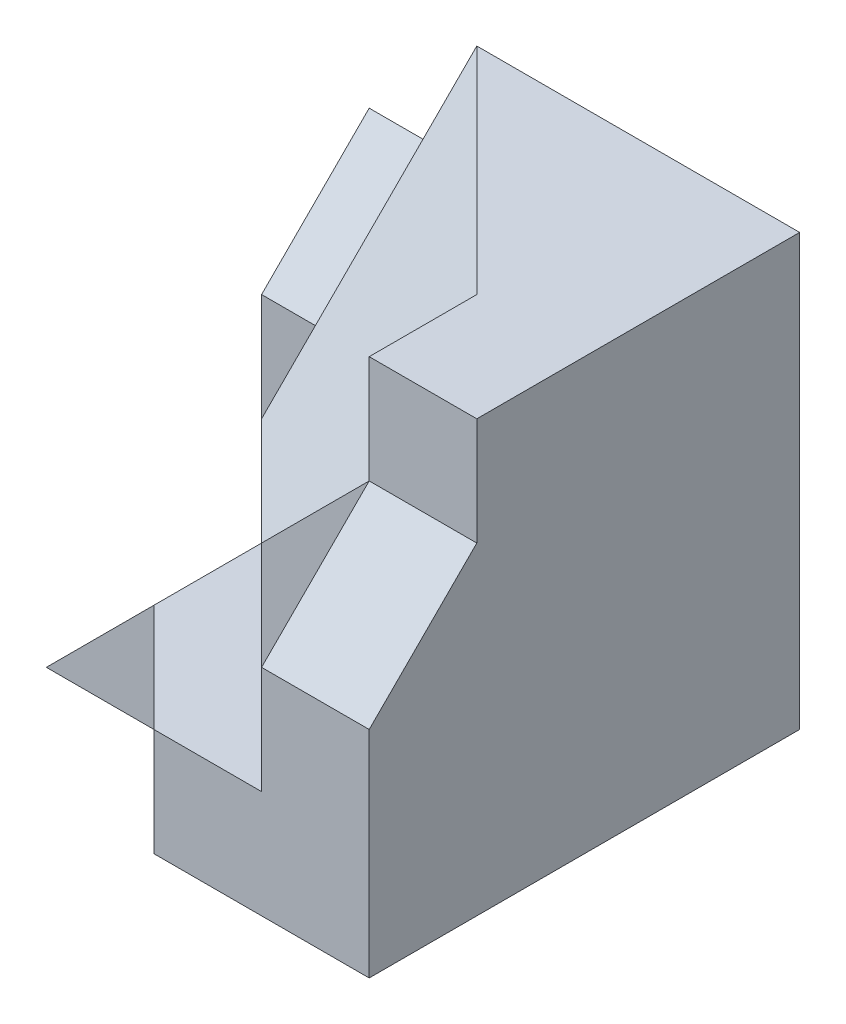
ISO-10303-21;
HEADER;
FILE_DESCRIPTION(('STEP AP214'),'2;1');
FILE_NAME('part.step','',(''),(''),'','','');
FILE_SCHEMA(('AUTOMOTIVE_DESIGN { 1 0 10303 214 1 1 1 1 }'));
ENDSEC;
DATA;
#1=APPLICATION_CONTEXT('core data for automotive mechanical design processes');
#2=APPLICATION_PROTOCOL_DEFINITION('international standard','automotive_design',2000,#1);
#3=PRODUCT_CONTEXT('',#1,'mechanical');
#4=PRODUCT('Part','Part','',(#3));
#5=PRODUCT_RELATED_PRODUCT_CATEGORY('part','',(#4));
#6=PRODUCT_DEFINITION_FORMATION('','',#4);
#7=PRODUCT_DEFINITION_CONTEXT('part definition',#1,'design');
#8=PRODUCT_DEFINITION('design','',#6,#7);
#9=PRODUCT_DEFINITION_SHAPE('','',#8);
#10=(LENGTH_UNIT() NAMED_UNIT(*) SI_UNIT(.MILLI.,.METRE.));
#11=(NAMED_UNIT(*) PLANE_ANGLE_UNIT() SI_UNIT($,.RADIAN.));
#12=(NAMED_UNIT(*) SI_UNIT($,.STERADIAN.) SOLID_ANGLE_UNIT());
#13=UNCERTAINTY_MEASURE_WITH_UNIT(LENGTH_MEASURE(1.E-05),#10,'distance_accuracy_value','');
#14=(GEOMETRIC_REPRESENTATION_CONTEXT(3) GLOBAL_UNCERTAINTY_ASSIGNED_CONTEXT((#13)) GLOBAL_UNIT_ASSIGNED_CONTEXT((#10,
#11,#12)) REPRESENTATION_CONTEXT('',''));
#15=CARTESIAN_POINT('',(0.,0.,0.));
#16=DIRECTION('',(0.,0.,1.));
#17=DIRECTION('',(1.,0.,0.));
#18=AXIS2_PLACEMENT_3D('',#15,#16,#17);
#19=CARTESIAN_POINT('',(0.,20.,15.));
#20=DIRECTION('',(0.,0.,-1.));
#21=DIRECTION('',(-1.,0.,0.));
#22=AXIS2_PLACEMENT_3D('',#19,#20,#21);
#23=PLANE('',#22);
#24=DIRECTION('',(1.,0.,0.));
#25=VECTOR('',#24,1.);
#26=CARTESIAN_POINT('',(-10.,5.,15.));
#27=LINE('',#26,#25);
#28=CARTESIAN_POINT('',(-10.,5.,15.));
#29=VERTEX_POINT('',#28);
#30=CARTESIAN_POINT('',(-5.,5.,15.));
#31=VERTEX_POINT('',#30);
#32=EDGE_CURVE('E311',#29,#31,#27,.T.);
#33=ORIENTED_EDGE('',*,*,#32,.T.);
#34=DIRECTION('',(0.,-1.,0.));
#35=VECTOR('',#34,1.);
#36=CARTESIAN_POINT('',(-5.,20.,15.));
#37=LINE('',#36,#35);
#38=CARTESIAN_POINT('',(-5.,15.,15.));
#39=VERTEX_POINT('',#38);
#40=EDGE_CURVE('E243',#39,#31,#37,.T.);
#41=ORIENTED_EDGE('',*,*,#40,.F.);
#42=DIRECTION('',(-0.707106781186548,-0.707106781186547,0.));
#43=VECTOR('',#42,1.);
#44=CARTESIAN_POINT('',(-5.,15.,15.));
#45=LINE('',#44,#43);
#46=CARTESIAN_POINT('',(-10.,10.,15.));
#47=VERTEX_POINT('',#46);
#48=EDGE_CURVE('E211',#39,#47,#45,.T.);
#49=ORIENTED_EDGE('',*,*,#48,.T.);
#50=DIRECTION('',(0.,-1.,0.));
#51=VECTOR('',#50,1.);
#52=CARTESIAN_POINT('',(-10.,20.,15.));
#53=LINE('',#52,#51);
#54=EDGE_CURVE('E255',#47,#29,#53,.T.);
#55=ORIENTED_EDGE('',*,*,#54,.T.);
#56=EDGE_LOOP('',(#33,#41,#49,#55));
#57=FACE_BOUND('',#56,.T.);
#58=ADVANCED_FACE('F34',(#57),#23,.F.);
#59=CARTESIAN_POINT('',(-15.,20.,9.99999999999999));
#60=DIRECTION('',(-0.707106781186548,0.,0.707106781186547));
#61=DIRECTION('',(0.707106781186547,0.,0.707106781186548));
#62=AXIS2_PLACEMENT_3D('',#59,#60,#61);
#63=PLANE('',#62);
#64=DIRECTION('',(0.,-1.,0.));
#65=VECTOR('',#64,1.);
#66=CARTESIAN_POINT('',(-15.,20.,9.99999999999999));
#67=LINE('',#66,#65);
#68=CARTESIAN_POINT('',(-15.,10.,9.99999999999999));
#69=VERTEX_POINT('',#68);
#70=CARTESIAN_POINT('',(-15.,5.,9.99999999999999));
#71=VERTEX_POINT('',#70);
#72=EDGE_CURVE('E251',#69,#71,#67,.T.);
#73=ORIENTED_EDGE('',*,*,#72,.T.);
#74=DIRECTION('',(0.707106781186547,0.,0.707106781186548));
#75=VECTOR('',#74,1.);
#76=CARTESIAN_POINT('',(-15.,5.,9.99999999999999));
#77=LINE('',#76,#75);
#78=EDGE_CURVE('E148',#71,#29,#77,.T.);
#79=ORIENTED_EDGE('',*,*,#78,.T.);
#80=ORIENTED_EDGE('',*,*,#54,.F.);
#81=DIRECTION('',(-0.707106781186548,0.,-0.707106781186548));
#82=VECTOR('',#81,1.);
#83=CARTESIAN_POINT('',(-10.,10.,15.));
#84=LINE('',#83,#82);
#85=EDGE_CURVE('E207',#47,#69,#84,.T.);
#86=ORIENTED_EDGE('',*,*,#85,.T.);
#87=EDGE_LOOP('',(#73,#79,#80,#86));
#88=FACE_BOUND('',#87,.T.);
#89=ADVANCED_FACE('F312',(#88),#63,.T.);
#90=CARTESIAN_POINT('',(-5.,20.,15.));
#91=DIRECTION('',(1.,0.,0.));
#92=DIRECTION('',(0.,0.,-1.));
#93=AXIS2_PLACEMENT_3D('',#90,#91,#92);
#94=PLANE('',#93);
#95=DIRECTION('',(0.,0.,1.));
#96=VECTOR('',#95,1.);
#97=CARTESIAN_POINT('',(-5.,5.,15.));
#98=LINE('',#97,#96);
#99=CARTESIAN_POINT('',(-5.,5.,20.));
#100=VERTEX_POINT('',#99);
#101=EDGE_CURVE('E314',#31,#100,#98,.T.);
#102=ORIENTED_EDGE('',*,*,#101,.T.);
#103=DIRECTION('',(0.,-1.,0.));
#104=VECTOR('',#103,1.);
#105=CARTESIAN_POINT('',(-5.,0.,20.));
#106=LINE('',#105,#104);
#107=CARTESIAN_POINT('',(-5.,10.,20.));
#108=VERTEX_POINT('',#107);
#109=EDGE_CURVE('E279',#108,#100,#106,.T.);
#110=ORIENTED_EDGE('',*,*,#109,.F.);
#111=DIRECTION('',(0.,-0.707106781186548,0.707106781186548));
#112=VECTOR('',#111,1.);
#113=CARTESIAN_POINT('',(-5.,15.,15.));
#114=LINE('',#113,#112);
#115=EDGE_CURVE('E254',#39,#108,#114,.T.);
#116=ORIENTED_EDGE('',*,*,#115,.F.);
#117=ORIENTED_EDGE('',*,*,#40,.T.);
#118=EDGE_LOOP('',(#102,#110,#116,#117));
#119=FACE_BOUND('',#118,.T.);
#120=ADVANCED_FACE('F36',(#119),#94,.F.);
#121=CARTESIAN_POINT('',(-15.,20.,0.));
#122=DIRECTION('',(-1.,0.,0.));
#123=DIRECTION('',(0.,0.,1.));
#124=AXIS2_PLACEMENT_3D('',#121,#122,#123);
#125=PLANE('',#124);
#126=DIRECTION('',(0.,1.,0.));
#127=VECTOR('',#126,1.);
#128=CARTESIAN_POINT('',(-15.,10.,5.));
#129=LINE('',#128,#127);
#130=CARTESIAN_POINT('',(-15.,5.,5.));
#131=VERTEX_POINT('',#130);
#132=CARTESIAN_POINT('',(-15.,10.,5.));
#133=VERTEX_POINT('',#132);
#134=EDGE_CURVE('E38',#131,#133,#129,.T.);
#135=ORIENTED_EDGE('',*,*,#134,.F.);
#136=DIRECTION('',(0.,0.,-1.));
#137=VECTOR('',#136,1.);
#138=CARTESIAN_POINT('',(-15.,5.,15.));
#139=LINE('',#138,#137);
#140=EDGE_CURVE('E152',#71,#131,#139,.T.);
#141=ORIENTED_EDGE('',*,*,#140,.F.);
#142=ORIENTED_EDGE('',*,*,#72,.F.);
#143=DIRECTION('',(0.,0.707106781186547,-0.707106781186548));
#144=VECTOR('',#143,1.);
#145=CARTESIAN_POINT('',(-15.,10.,10.));
#146=LINE('',#145,#144);
#147=CARTESIAN_POINT('',(-15.,20.,0.));
#148=VERTEX_POINT('',#147);
#149=EDGE_CURVE('E59',#69,#148,#146,.T.);
#150=ORIENTED_EDGE('',*,*,#149,.T.);
#151=DIRECTION('',(0.,-1.,0.));
#152=VECTOR('',#151,1.);
#153=CARTESIAN_POINT('',(-15.,20.,0.));
#154=LINE('',#153,#152);
#155=CARTESIAN_POINT('',(-15.,15.,0.));
#156=VERTEX_POINT('',#155);
#157=EDGE_CURVE('E52',#148,#156,#154,.T.);
#158=ORIENTED_EDGE('',*,*,#157,.T.);
#159=DIRECTION('',(0.,0.707106781186548,-0.707106781186548));
#160=VECTOR('',#159,1.);
#161=CARTESIAN_POINT('',(-15.,15.,0.));
#162=LINE('',#161,#160);
#163=EDGE_CURVE('E185',#133,#156,#162,.T.);
#164=ORIENTED_EDGE('',*,*,#163,.F.);
#165=EDGE_LOOP('',(#135,#141,#142,#150,#158,#164));
#166=FACE_BOUND('',#165,.T.);
#167=ADVANCED_FACE('F326',(#166),#125,.T.);
#168=CARTESIAN_POINT('',(-20.,10.,5.));
#169=DIRECTION('',(0.,0.,-1.));
#170=DIRECTION('',(0.,1.,0.));
#171=AXIS2_PLACEMENT_3D('',#168,#169,#170);
#172=PLANE('',#171);
#173=DIRECTION('',(0.,1.,0.));
#174=VECTOR('',#173,1.);
#175=CARTESIAN_POINT('',(-20.,10.,5.));
#176=LINE('',#175,#174);
#177=CARTESIAN_POINT('',(-20.,0.,5.));
#178=VERTEX_POINT('',#177);
#179=CARTESIAN_POINT('',(-20.,10.,5.));
#180=VERTEX_POINT('',#179);
#181=EDGE_CURVE('E184',#178,#180,#176,.T.);
#182=ORIENTED_EDGE('',*,*,#181,.F.);
#183=DIRECTION('',(0.707106781186548,0.707106781186548,0.));
#184=VECTOR('',#183,1.);
#185=CARTESIAN_POINT('',(-20.,0.,5.));
#186=LINE('',#185,#184);
#187=EDGE_CURVE('E173',#178,#131,#186,.T.);
#188=ORIENTED_EDGE('',*,*,#187,.T.);
#189=ORIENTED_EDGE('',*,*,#134,.T.);
#190=DIRECTION('',(1.,0.,0.));
#191=VECTOR('',#190,1.);
#192=CARTESIAN_POINT('',(-20.,10.,5.));
#193=LINE('',#192,#191);
#194=EDGE_CURVE('E195',#180,#133,#193,.T.);
#195=ORIENTED_EDGE('',*,*,#194,.F.);
#196=EDGE_LOOP('',(#182,#188,#189,#195));
#197=FACE_BOUND('',#196,.T.);
#198=ADVANCED_FACE('F325',(#197),#172,.F.);
#199=DIRECTION('',(0.,1.,0.));
#200=VECTOR('',#199,1.);
#201=CARTESIAN_POINT('',(-5.,20.,15.));
#202=LINE('',#201,#200);
#203=CARTESIAN_POINT('',(-5.,20.,15.));
#204=VERTEX_POINT('',#203);
#205=EDGE_CURVE('E223',#39,#204,#202,.T.);
#206=ORIENTED_EDGE('',*,*,#205,.F.);
#207=DIRECTION('',(-1.,0.,0.));
#208=VECTOR('',#207,1.);
#209=CARTESIAN_POINT('',(-5.,15.,15.));
#210=LINE('',#209,#208);
#211=CARTESIAN_POINT('',(0.,15.,15.));
#212=VERTEX_POINT('',#211);
#213=EDGE_CURVE('E275',#212,#39,#210,.T.);
#214=ORIENTED_EDGE('',*,*,#213,.F.);
#215=DIRECTION('',(0.,-1.,0.));
#216=VECTOR('',#215,1.);
#217=CARTESIAN_POINT('',(0.,20.,15.));
#218=LINE('',#217,#216);
#219=CARTESIAN_POINT('',(0.,20.,15.));
#220=VERTEX_POINT('',#219);
#221=EDGE_CURVE('E12',#220,#212,#218,.T.);
#222=ORIENTED_EDGE('',*,*,#221,.F.);
#223=DIRECTION('',(1.,0.,0.));
#224=VECTOR('',#223,1.);
#225=CARTESIAN_POINT('',(0.,20.,15.));
#226=LINE('',#225,#224);
#227=EDGE_CURVE('E288',#204,#220,#226,.T.);
#228=ORIENTED_EDGE('',*,*,#227,.F.);
#229=EDGE_LOOP('',(#206,#214,#222,#228));
#230=FACE_BOUND('',#229,.T.);
#231=ADVANCED_FACE('F348',(#230),#23,.F.);
#232=CARTESIAN_POINT('',(0.,20.,0.));
#233=DIRECTION('',(-1.,0.,0.));
#234=DIRECTION('',(0.,0.,1.));
#235=AXIS2_PLACEMENT_3D('',#232,#233,#234);
#236=PLANE('',#235);
#237=ORIENTED_EDGE('',*,*,#221,.T.);
#238=DIRECTION('',(0.,-0.707106781186548,0.707106781186548));
#239=VECTOR('',#238,1.);
#240=CARTESIAN_POINT('',(0.,15.,15.));
#241=LINE('',#240,#239);
#242=CARTESIAN_POINT('',(0.,10.,20.));
#243=VERTEX_POINT('',#242);
#244=EDGE_CURVE('E281',#212,#243,#241,.T.);
#245=ORIENTED_EDGE('',*,*,#244,.T.);
#246=DIRECTION('',(0.,1.,0.));
#247=VECTOR('',#246,1.);
#248=CARTESIAN_POINT('',(0.,15.,20.));
#249=LINE('',#248,#247);
#250=CARTESIAN_POINT('',(0.,0.,20.));
#251=VERTEX_POINT('',#250);
#252=EDGE_CURVE('E286',#251,#243,#249,.T.);
#253=ORIENTED_EDGE('',*,*,#252,.F.);
#254=DIRECTION('',(0.,0.,-1.));
#255=VECTOR('',#254,1.);
#256=CARTESIAN_POINT('',(0.,0.,0.));
#257=LINE('',#256,#255);
#258=CARTESIAN_POINT('',(0.,0.,0.));
#259=VERTEX_POINT('',#258);
#260=EDGE_CURVE('E290',#251,#259,#257,.T.);
#261=ORIENTED_EDGE('',*,*,#260,.T.);
#262=DIRECTION('',(0.,-1.,0.));
#263=VECTOR('',#262,1.);
#264=CARTESIAN_POINT('',(0.,20.,0.));
#265=LINE('',#264,#263);
#266=CARTESIAN_POINT('',(0.,20.,0.));
#267=VERTEX_POINT('',#266);
#268=EDGE_CURVE('E44',#267,#259,#265,.T.);
#269=ORIENTED_EDGE('',*,*,#268,.F.);
#270=DIRECTION('',(0.,0.,-1.));
#271=VECTOR('',#270,1.);
#272=CARTESIAN_POINT('',(0.,20.,0.));
#273=LINE('',#272,#271);
#274=EDGE_CURVE('E260',#220,#267,#273,.T.);
#275=ORIENTED_EDGE('',*,*,#274,.F.);
#276=EDGE_LOOP('',(#237,#245,#253,#261,#269,#275));
#277=FACE_BOUND('',#276,.T.);
#278=ADVANCED_FACE('F341',(#277),#236,.F.);
#279=CARTESIAN_POINT('',(-15.,20.,0.));
#280=DIRECTION('',(0.,0.,1.));
#281=DIRECTION('',(1.,0.,0.));
#282=AXIS2_PLACEMENT_3D('',#279,#280,#281);
#283=PLANE('',#282);
#284=DIRECTION('',(-1.,0.,0.));
#285=VECTOR('',#284,1.);
#286=CARTESIAN_POINT('',(-15.,0.,0.));
#287=LINE('',#286,#285);
#288=CARTESIAN_POINT('',(-20.,0.,0.));
#289=VERTEX_POINT('',#288);
#290=EDGE_CURVE('E271',#259,#289,#287,.T.);
#291=ORIENTED_EDGE('',*,*,#290,.T.);
#292=DIRECTION('',(0.,-1.,0.));
#293=VECTOR('',#292,1.);
#294=CARTESIAN_POINT('',(-20.,0.,0.));
#295=LINE('',#294,#293);
#296=CARTESIAN_POINT('',(-20.,15.,0.));
#297=VERTEX_POINT('',#296);
#298=EDGE_CURVE('E189',#297,#289,#295,.T.);
#299=ORIENTED_EDGE('',*,*,#298,.F.);
#300=DIRECTION('',(1.,0.,0.));
#301=VECTOR('',#300,1.);
#302=CARTESIAN_POINT('',(-20.,15.,0.));
#303=LINE('',#302,#301);
#304=EDGE_CURVE('E192',#297,#156,#303,.T.);
#305=ORIENTED_EDGE('',*,*,#304,.T.);
#306=ORIENTED_EDGE('',*,*,#157,.F.);
#307=DIRECTION('',(-1.,0.,0.));
#308=VECTOR('',#307,1.);
#309=CARTESIAN_POINT('',(-15.,20.,0.));
#310=LINE('',#309,#308);
#311=EDGE_CURVE('E257',#267,#148,#310,.T.);
#312=ORIENTED_EDGE('',*,*,#311,.F.);
#313=ORIENTED_EDGE('',*,*,#268,.T.);
#314=EDGE_LOOP('',(#291,#299,#305,#306,#312,#313));
#315=FACE_BOUND('',#314,.T.);
#316=ADVANCED_FACE('F328',(#315),#283,.F.);
#317=CARTESIAN_POINT('',(0.,20.,0.));
#318=DIRECTION('',(0.,-1.,0.));
#319=DIRECTION('',(0.,0.,-1.));
#320=AXIS2_PLACEMENT_3D('',#317,#318,#319);
#321=PLANE('',#320);
#322=ORIENTED_EDGE('',*,*,#311,.T.);
#323=DIRECTION('',(0.707106781186548,0.,0.707106781186547));
#324=VECTOR('',#323,1.);
#325=CARTESIAN_POINT('',(-15.,20.,0.));
#326=LINE('',#325,#324);
#327=CARTESIAN_POINT('',(-5.,20.,10.));
#328=VERTEX_POINT('',#327);
#329=EDGE_CURVE('E224',#148,#328,#326,.T.);
#330=ORIENTED_EDGE('',*,*,#329,.T.);
#331=DIRECTION('',(0.,0.,1.));
#332=VECTOR('',#331,1.);
#333=CARTESIAN_POINT('',(-5.,20.,10.));
#334=LINE('',#333,#332);
#335=EDGE_CURVE('E217',#328,#204,#334,.T.);
#336=ORIENTED_EDGE('',*,*,#335,.T.);
#337=ORIENTED_EDGE('',*,*,#227,.T.);
#338=ORIENTED_EDGE('',*,*,#274,.T.);
#339=EDGE_LOOP('',(#322,#330,#336,#337,#338));
#340=FACE_BOUND('',#339,.T.);
#341=ADVANCED_FACE('F354',(#340),#321,.F.);
#342=CARTESIAN_POINT('',(0.,0.,0.));
#343=DIRECTION('',(0.,-1.,0.));
#344=DIRECTION('',(0.,0.,-1.));
#345=AXIS2_PLACEMENT_3D('',#342,#343,#344);
#346=PLANE('',#345);
#347=DIRECTION('',(1.,0.,0.));
#348=VECTOR('',#347,1.);
#349=CARTESIAN_POINT('',(0.,0.,20.));
#350=LINE('',#349,#348);
#351=CARTESIAN_POINT('',(-10.,0.,20.));
#352=VERTEX_POINT('',#351);
#353=EDGE_CURVE('E294',#352,#251,#350,.T.);
#354=ORIENTED_EDGE('',*,*,#353,.F.);
#355=DIRECTION('',(-0.707106781186548,0.,-0.707106781186548));
#356=VECTOR('',#355,1.);
#357=CARTESIAN_POINT('',(-10.,0.,20.));
#358=LINE('',#357,#356);
#359=CARTESIAN_POINT('',(-15.,0.,15.));
#360=VERTEX_POINT('',#359);
#361=EDGE_CURVE('E162',#352,#360,#358,.T.);
#362=ORIENTED_EDGE('',*,*,#361,.T.);
#363=DIRECTION('',(1.,0.,0.));
#364=VECTOR('',#363,1.);
#365=CARTESIAN_POINT('',(-20.,0.,15.));
#366=LINE('',#365,#364);
#367=CARTESIAN_POINT('',(-20.,0.,15.));
#368=VERTEX_POINT('',#367);
#369=EDGE_CURVE('E176',#368,#360,#366,.T.);
#370=ORIENTED_EDGE('',*,*,#369,.F.);
#371=DIRECTION('',(0.,0.,1.));
#372=VECTOR('',#371,1.);
#373=CARTESIAN_POINT('',(-20.,0.,5.));
#374=LINE('',#373,#372);
#375=EDGE_CURVE('E169',#178,#368,#374,.T.);
#376=ORIENTED_EDGE('',*,*,#375,.F.);
#377=DIRECTION('',(0.,0.,1.));
#378=VECTOR('',#377,1.);
#379=CARTESIAN_POINT('',(-20.,0.,5.));
#380=LINE('',#379,#378);
#381=EDGE_CURVE('E181',#289,#178,#380,.T.);
#382=ORIENTED_EDGE('',*,*,#381,.F.);
#383=ORIENTED_EDGE('',*,*,#290,.F.);
#384=ORIENTED_EDGE('',*,*,#260,.F.);
#385=EDGE_LOOP('',(#354,#362,#370,#376,#382,#383,#384));
#386=FACE_BOUND('',#385,.T.);
#387=ADVANCED_FACE('F333',(#386),#346,.T.);
#388=CARTESIAN_POINT('',(0.,0.,20.));
#389=DIRECTION('',(0.,0.,-1.));
#390=DIRECTION('',(-1.,0.,0.));
#391=AXIS2_PLACEMENT_3D('',#388,#389,#390);
#392=PLANE('',#391);
#393=ORIENTED_EDGE('',*,*,#252,.T.);
#394=DIRECTION('',(-1.,0.,0.));
#395=VECTOR('',#394,1.);
#396=CARTESIAN_POINT('',(0.,10.,20.));
#397=LINE('',#396,#395);
#398=EDGE_CURVE('E280',#243,#108,#397,.T.);
#399=ORIENTED_EDGE('',*,*,#398,.T.);
#400=ORIENTED_EDGE('',*,*,#109,.T.);
#401=DIRECTION('',(-1.,0.,0.));
#402=VECTOR('',#401,1.);
#403=CARTESIAN_POINT('',(-5.,5.,20.));
#404=LINE('',#403,#402);
#405=CARTESIAN_POINT('',(-10.,5.,20.));
#406=VERTEX_POINT('',#405);
#407=EDGE_CURVE('E318',#100,#406,#404,.T.);
#408=ORIENTED_EDGE('',*,*,#407,.T.);
#409=DIRECTION('',(0.,-1.,0.));
#410=VECTOR('',#409,1.);
#411=CARTESIAN_POINT('',(-10.,5.,20.));
#412=LINE('',#411,#410);
#413=EDGE_CURVE('E161',#406,#352,#412,.T.);
#414=ORIENTED_EDGE('',*,*,#413,.T.);
#415=ORIENTED_EDGE('',*,*,#353,.T.);
#416=EDGE_LOOP('',(#393,#399,#400,#408,#414,#415));
#417=FACE_BOUND('',#416,.T.);
#418=ADVANCED_FACE('F334',(#417),#392,.F.);
#419=CARTESIAN_POINT('',(0.,15.,15.));
#420=DIRECTION('',(0.,-0.707106781186548,-0.707106781186548));
#421=DIRECTION('',(0.,0.707106781186548,-0.707106781186548));
#422=AXIS2_PLACEMENT_3D('',#419,#420,#421);
#423=PLANE('',#422);
#424=ORIENTED_EDGE('',*,*,#115,.T.);
#425=ORIENTED_EDGE('',*,*,#398,.F.);
#426=ORIENTED_EDGE('',*,*,#244,.F.);
#427=ORIENTED_EDGE('',*,*,#213,.T.);
#428=EDGE_LOOP('',(#424,#425,#426,#427));
#429=FACE_BOUND('',#428,.T.);
#430=ADVANCED_FACE('F345',(#429),#423,.F.);
#431=CARTESIAN_POINT('',(-5.,20.,10.));
#432=DIRECTION('',(-1.,0.,0.));
#433=DIRECTION('',(0.,0.,1.));
#434=AXIS2_PLACEMENT_3D('',#431,#432,#433);
#435=PLANE('',#434);
#436=ORIENTED_EDGE('',*,*,#205,.T.);
#437=ORIENTED_EDGE('',*,*,#335,.F.);
#438=DIRECTION('',(0.,-0.707106781186548,0.707106781186548));
#439=VECTOR('',#438,1.);
#440=CARTESIAN_POINT('',(-5.,20.,10.));
#441=LINE('',#440,#439);
#442=EDGE_CURVE('E229',#328,#39,#441,.T.);
#443=ORIENTED_EDGE('',*,*,#442,.T.);
#444=EDGE_LOOP('',(#436,#437,#443));
#445=FACE_BOUND('',#444,.T.);
#446=ADVANCED_FACE('F352',(#445),#435,.T.);
#447=CARTESIAN_POINT('',(-11.6666666666667,11.6666666666667,11.6666666666667));
#448=DIRECTION('',(0.577350269189626,-0.577350269189626,-0.577350269189625));
#449=DIRECTION('',(0.707106781186547,0.707106781186548,0.));
#450=AXIS2_PLACEMENT_3D('',#447,#448,#449);
#451=PLANE('',#450);
#452=ORIENTED_EDGE('',*,*,#85,.F.);
#453=ORIENTED_EDGE('',*,*,#48,.F.);
#454=ORIENTED_EDGE('',*,*,#442,.F.);
#455=ORIENTED_EDGE('',*,*,#329,.F.);
#456=ORIENTED_EDGE('',*,*,#149,.F.);
#457=EDGE_LOOP('',(#452,#453,#454,#455,#456));
#458=FACE_BOUND('',#457,.T.);
#459=ADVANCED_FACE('F355',(#458),#451,.F.);
#460=CARTESIAN_POINT('',(-20.,15.,0.));
#461=DIRECTION('',(0.,-0.707106781186548,-0.707106781186548));
#462=DIRECTION('',(0.,0.707106781186548,-0.707106781186548));
#463=AXIS2_PLACEMENT_3D('',#460,#461,#462);
#464=PLANE('',#463);
#465=ORIENTED_EDGE('',*,*,#163,.T.);
#466=ORIENTED_EDGE('',*,*,#304,.F.);
#467=DIRECTION('',(0.,0.707106781186548,-0.707106781186548));
#468=VECTOR('',#467,1.);
#469=CARTESIAN_POINT('',(-20.,15.,0.));
#470=LINE('',#469,#468);
#471=EDGE_CURVE('E187',#180,#297,#470,.T.);
#472=ORIENTED_EDGE('',*,*,#471,.F.);
#473=ORIENTED_EDGE('',*,*,#194,.T.);
#474=EDGE_LOOP('',(#465,#466,#472,#473));
#475=FACE_BOUND('',#474,.T.);
#476=ADVANCED_FACE('F327',(#475),#464,.F.);
#477=CARTESIAN_POINT('',(-20.,0.,0.));
#478=DIRECTION('',(1.,0.,0.));
#479=DIRECTION('',(0.,0.,-1.));
#480=AXIS2_PLACEMENT_3D('',#477,#478,#479);
#481=PLANE('',#480);
#482=ORIENTED_EDGE('',*,*,#381,.T.);
#483=ORIENTED_EDGE('',*,*,#181,.T.);
#484=ORIENTED_EDGE('',*,*,#471,.T.);
#485=ORIENTED_EDGE('',*,*,#298,.T.);
#486=EDGE_LOOP('',(#482,#483,#484,#485));
#487=FACE_BOUND('',#486,.T.);
#488=ADVANCED_FACE('F331',(#487),#481,.F.);
#489=CARTESIAN_POINT('',(0.,0.,15.));
#490=DIRECTION('',(0.,0.,-1.));
#491=DIRECTION('',(-1.,0.,0.));
#492=AXIS2_PLACEMENT_3D('',#489,#490,#491);
#493=PLANE('',#492);
#494=DIRECTION('',(0.,1.,0.));
#495=VECTOR('',#494,1.);
#496=CARTESIAN_POINT('',(-15.,0.,15.));
#497=LINE('',#496,#495);
#498=CARTESIAN_POINT('',(-15.,5.,15.));
#499=VERTEX_POINT('',#498);
#500=EDGE_CURVE('E158',#360,#499,#497,.T.);
#501=ORIENTED_EDGE('',*,*,#500,.T.);
#502=DIRECTION('',(0.707106781186548,0.707106781186548,0.));
#503=VECTOR('',#502,1.);
#504=CARTESIAN_POINT('',(-20.,0.,15.));
#505=LINE('',#504,#503);
#506=EDGE_CURVE('E165',#368,#499,#505,.T.);
#507=ORIENTED_EDGE('',*,*,#506,.F.);
#508=ORIENTED_EDGE('',*,*,#369,.T.);
#509=EDGE_LOOP('',(#501,#507,#508));
#510=FACE_BOUND('',#509,.T.);
#511=ADVANCED_FACE('F175',(#510),#493,.F.);
#512=CARTESIAN_POINT('',(-20.,0.,5.));
#513=DIRECTION('',(0.707106781186548,-0.707106781186548,0.));
#514=DIRECTION('',(0.707106781186548,0.707106781186548,0.));
#515=AXIS2_PLACEMENT_3D('',#512,#513,#514);
#516=PLANE('',#515);
#517=ORIENTED_EDGE('',*,*,#506,.T.);
#518=EDGE_CURVE('E142',#499,#71,#139,.T.);
#519=ORIENTED_EDGE('',*,*,#518,.T.);
#520=ORIENTED_EDGE('',*,*,#140,.T.);
#521=ORIENTED_EDGE('',*,*,#187,.F.);
#522=ORIENTED_EDGE('',*,*,#375,.T.);
#523=EDGE_LOOP('',(#517,#519,#520,#521,#522));
#524=FACE_BOUND('',#523,.T.);
#525=ADVANCED_FACE('F166',(#524),#516,.F.);
#526=CARTESIAN_POINT('',(-10.,5.,20.));
#527=DIRECTION('',(-0.707106781186548,0.,0.707106781186548));
#528=DIRECTION('',(0.707106781186548,0.,0.707106781186548));
#529=AXIS2_PLACEMENT_3D('',#526,#527,#528);
#530=PLANE('',#529);
#531=ORIENTED_EDGE('',*,*,#361,.F.);
#532=ORIENTED_EDGE('',*,*,#413,.F.);
#533=DIRECTION('',(-0.707106781186548,0.,-0.707106781186548));
#534=VECTOR('',#533,1.);
#535=CARTESIAN_POINT('',(-10.,5.,20.));
#536=LINE('',#535,#534);
#537=EDGE_CURVE('E145',#406,#499,#536,.T.);
#538=ORIENTED_EDGE('',*,*,#537,.T.);
#539=ORIENTED_EDGE('',*,*,#500,.F.);
#540=EDGE_LOOP('',(#531,#532,#538,#539));
#541=FACE_BOUND('',#540,.T.);
#542=ADVANCED_FACE('F156',(#541),#530,.T.);
#543=CARTESIAN_POINT('',(0.,5.,0.));
#544=DIRECTION('',(0.,-1.,0.));
#545=DIRECTION('',(0.,0.,-1.));
#546=AXIS2_PLACEMENT_3D('',#543,#544,#545);
#547=PLANE('',#546);
#548=ORIENTED_EDGE('',*,*,#537,.F.);
#549=ORIENTED_EDGE('',*,*,#407,.F.);
#550=ORIENTED_EDGE('',*,*,#101,.F.);
#551=ORIENTED_EDGE('',*,*,#32,.F.);
#552=ORIENTED_EDGE('',*,*,#78,.F.);
#553=ORIENTED_EDGE('',*,*,#518,.F.);
#554=EDGE_LOOP('',(#548,#549,#550,#551,#552,#553));
#555=FACE_BOUND('',#554,.T.);
#556=ADVANCED_FACE('F144',(#555),#547,.F.);
#557=CLOSED_SHELL('',(#58,#89,#120,#167,#198,#231,#278,#316,#341,#387,#418,#430,#446,#459,#476,
#488,#511,#525,#542,#556));
#558=MANIFOLD_SOLID_BREP('B2',#557);
#559=ADVANCED_BREP_SHAPE_REPRESENTATION('',(#18,#558),#14);
#560=SHAPE_DEFINITION_REPRESENTATION(#9,#559);
ENDSEC;
END-ISO-10303-21;
